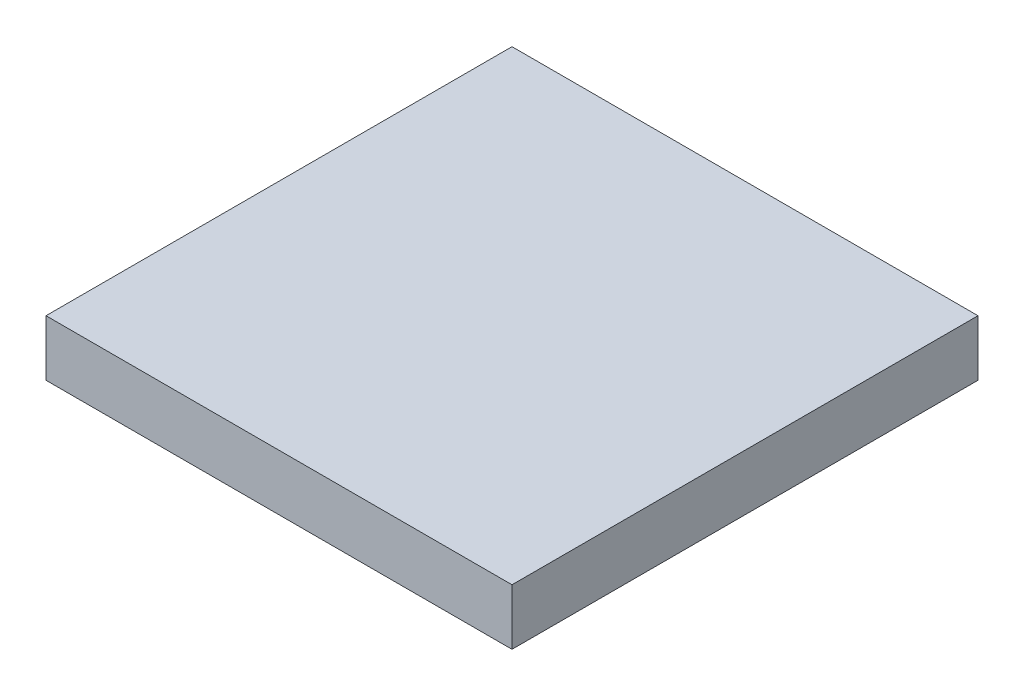
ISO-10303-21;
HEADER;
FILE_DESCRIPTION(('STEP AP214'),'2;1');
FILE_NAME('part.step','',(''),(''),'','','');
FILE_SCHEMA(('AUTOMOTIVE_DESIGN { 1 0 10303 214 1 1 1 1 }'));
ENDSEC;
DATA;
#1=APPLICATION_CONTEXT('core data for automotive mechanical design processes');
#2=APPLICATION_PROTOCOL_DEFINITION('international standard','automotive_design',2000,#1);
#3=PRODUCT_CONTEXT('',#1,'mechanical');
#4=PRODUCT('Part','Part','',(#3));
#5=PRODUCT_RELATED_PRODUCT_CATEGORY('part','',(#4));
#6=PRODUCT_DEFINITION_FORMATION('','',#4);
#7=PRODUCT_DEFINITION_CONTEXT('part definition',#1,'design');
#8=PRODUCT_DEFINITION('design','',#6,#7);
#9=PRODUCT_DEFINITION_SHAPE('','',#8);
#10=(LENGTH_UNIT() NAMED_UNIT(*) SI_UNIT(.MILLI.,.METRE.));
#11=(NAMED_UNIT(*) PLANE_ANGLE_UNIT() SI_UNIT($,.RADIAN.));
#12=(NAMED_UNIT(*) SI_UNIT($,.STERADIAN.) SOLID_ANGLE_UNIT());
#13=UNCERTAINTY_MEASURE_WITH_UNIT(LENGTH_MEASURE(1.E-05),#10,'distance_accuracy_value','');
#14=(GEOMETRIC_REPRESENTATION_CONTEXT(3) GLOBAL_UNCERTAINTY_ASSIGNED_CONTEXT((#13)) GLOBAL_UNIT_ASSIGNED_CONTEXT((#10,
#11,#12)) REPRESENTATION_CONTEXT('',''));
#15=CARTESIAN_POINT('',(0.,0.,0.));
#16=DIRECTION('',(0.,0.,1.));
#17=DIRECTION('',(1.,0.,0.));
#18=AXIS2_PLACEMENT_3D('',#15,#16,#17);
#19=CARTESIAN_POINT('',(12.5,3.,12.5));
#20=DIRECTION('',(-1.,0.,0.));
#21=DIRECTION('',(0.,0.,1.));
#22=AXIS2_PLACEMENT_3D('',#19,#20,#21);
#23=PLANE('',#22);
#24=DIRECTION('',(0.,0.,-1.));
#25=VECTOR('',#24,1.);
#26=CARTESIAN_POINT('',(12.5,0.,12.5));
#27=LINE('',#26,#25);
#28=CARTESIAN_POINT('',(12.5,0.,12.5));
#29=VERTEX_POINT('',#28);
#30=CARTESIAN_POINT('',(12.5,0.,-12.5));
#31=VERTEX_POINT('',#30);
#32=EDGE_CURVE('E145',#29,#31,#27,.T.);
#33=ORIENTED_EDGE('',*,*,#32,.T.);
#34=DIRECTION('',(0.,-1.,0.));
#35=VECTOR('',#34,1.);
#36=CARTESIAN_POINT('',(12.5,3.,-12.5));
#37=LINE('',#36,#35);
#38=CARTESIAN_POINT('',(12.5,3.,-12.5));
#39=VERTEX_POINT('',#38);
#40=EDGE_CURVE('E11',#39,#31,#37,.T.);
#41=ORIENTED_EDGE('',*,*,#40,.F.);
#42=DIRECTION('',(0.,0.,-1.));
#43=VECTOR('',#42,1.);
#44=CARTESIAN_POINT('',(12.5,3.,12.5));
#45=LINE('',#44,#43);
#46=CARTESIAN_POINT('',(12.5,3.,12.5));
#47=VERTEX_POINT('',#46);
#48=EDGE_CURVE('E149',#47,#39,#45,.T.);
#49=ORIENTED_EDGE('',*,*,#48,.F.);
#50=DIRECTION('',(0.,-1.,0.));
#51=VECTOR('',#50,1.);
#52=CARTESIAN_POINT('',(12.5,3.,12.5));
#53=LINE('',#52,#51);
#54=EDGE_CURVE('E155',#47,#29,#53,.T.);
#55=ORIENTED_EDGE('',*,*,#54,.T.);
#56=EDGE_LOOP('',(#33,#41,#49,#55));
#57=FACE_BOUND('',#56,.T.);
#58=ADVANCED_FACE('F33',(#57),#23,.F.);
#59=CARTESIAN_POINT('',(-12.5,3.,-12.5));
#60=DIRECTION('',(0.,0.,1.));
#61=DIRECTION('',(1.,0.,0.));
#62=AXIS2_PLACEMENT_3D('',#59,#60,#61);
#63=PLANE('',#62);
#64=DIRECTION('',(-1.,0.,0.));
#65=VECTOR('',#64,1.);
#66=CARTESIAN_POINT('',(-12.5,0.,-12.5));
#67=LINE('',#66,#65);
#68=CARTESIAN_POINT('',(-12.5,0.,-12.5));
#69=VERTEX_POINT('',#68);
#70=EDGE_CURVE('E158',#31,#69,#67,.T.);
#71=ORIENTED_EDGE('',*,*,#70,.T.);
#72=DIRECTION('',(0.,-1.,0.));
#73=VECTOR('',#72,1.);
#74=CARTESIAN_POINT('',(-12.5,3.,-12.5));
#75=LINE('',#74,#73);
#76=CARTESIAN_POINT('',(-12.5,3.,-12.5));
#77=VERTEX_POINT('',#76);
#78=EDGE_CURVE('E40',#77,#69,#75,.T.);
#79=ORIENTED_EDGE('',*,*,#78,.F.);
#80=DIRECTION('',(-1.,0.,0.));
#81=VECTOR('',#80,1.);
#82=CARTESIAN_POINT('',(-12.5,3.,-12.5));
#83=LINE('',#82,#81);
#84=EDGE_CURVE('E84',#39,#77,#83,.T.);
#85=ORIENTED_EDGE('',*,*,#84,.F.);
#86=ORIENTED_EDGE('',*,*,#40,.T.);
#87=EDGE_LOOP('',(#71,#79,#85,#86));
#88=FACE_BOUND('',#87,.T.);
#89=ADVANCED_FACE('F186',(#88),#63,.F.);
#90=CARTESIAN_POINT('',(-12.5,3.,12.5));
#91=DIRECTION('',(1.,0.,0.));
#92=DIRECTION('',(0.,0.,-1.));
#93=AXIS2_PLACEMENT_3D('',#90,#91,#92);
#94=PLANE('',#93);
#95=DIRECTION('',(0.,0.,1.));
#96=VECTOR('',#95,1.);
#97=CARTESIAN_POINT('',(-12.5,0.,12.5));
#98=LINE('',#97,#96);
#99=CARTESIAN_POINT('',(-12.5,0.,12.5));
#100=VERTEX_POINT('',#99);
#101=EDGE_CURVE('E160',#69,#100,#98,.T.);
#102=ORIENTED_EDGE('',*,*,#101,.T.);
#103=DIRECTION('',(0.,-1.,0.));
#104=VECTOR('',#103,1.);
#105=CARTESIAN_POINT('',(-12.5,3.,12.5));
#106=LINE('',#105,#104);
#107=CARTESIAN_POINT('',(-12.5,3.,12.5));
#108=VERTEX_POINT('',#107);
#109=EDGE_CURVE('E164',#108,#100,#106,.T.);
#110=ORIENTED_EDGE('',*,*,#109,.F.);
#111=DIRECTION('',(0.,0.,1.));
#112=VECTOR('',#111,1.);
#113=CARTESIAN_POINT('',(-12.5,3.,12.5));
#114=LINE('',#113,#112);
#115=EDGE_CURVE('E152',#77,#108,#114,.T.);
#116=ORIENTED_EDGE('',*,*,#115,.F.);
#117=ORIENTED_EDGE('',*,*,#78,.T.);
#118=EDGE_LOOP('',(#102,#110,#116,#117));
#119=FACE_BOUND('',#118,.T.);
#120=ADVANCED_FACE('F169',(#119),#94,.F.);
#121=CARTESIAN_POINT('',(-12.5,3.,12.5));
#122=DIRECTION('',(0.,0.,-1.));
#123=DIRECTION('',(-1.,0.,0.));
#124=AXIS2_PLACEMENT_3D('',#121,#122,#123);
#125=PLANE('',#124);
#126=DIRECTION('',(1.,0.,0.));
#127=VECTOR('',#126,1.);
#128=CARTESIAN_POINT('',(-12.5,0.,12.5));
#129=LINE('',#128,#127);
#130=EDGE_CURVE('E77',#100,#29,#129,.T.);
#131=ORIENTED_EDGE('',*,*,#130,.T.);
#132=ORIENTED_EDGE('',*,*,#54,.F.);
#133=DIRECTION('',(1.,0.,0.));
#134=VECTOR('',#133,1.);
#135=CARTESIAN_POINT('',(-12.5,3.,12.5));
#136=LINE('',#135,#134);
#137=EDGE_CURVE('E56',#108,#47,#136,.T.);
#138=ORIENTED_EDGE('',*,*,#137,.F.);
#139=ORIENTED_EDGE('',*,*,#109,.T.);
#140=EDGE_LOOP('',(#131,#132,#138,#139));
#141=FACE_BOUND('',#140,.T.);
#142=ADVANCED_FACE('F177',(#141),#125,.F.);
#143=CARTESIAN_POINT('',(0.,3.,0.));
#144=DIRECTION('',(0.,-1.,0.));
#145=DIRECTION('',(0.,0.,-1.));
#146=AXIS2_PLACEMENT_3D('',#143,#144,#145);
#147=PLANE('',#146);
#148=ORIENTED_EDGE('',*,*,#48,.T.);
#149=ORIENTED_EDGE('',*,*,#84,.T.);
#150=ORIENTED_EDGE('',*,*,#115,.T.);
#151=ORIENTED_EDGE('',*,*,#137,.T.);
#152=EDGE_LOOP('',(#148,#149,#150,#151));
#153=FACE_BOUND('',#152,.T.);
#154=ADVANCED_FACE('F179',(#153),#147,.F.);
#155=CARTESIAN_POINT('',(0.,0.,0.));
#156=DIRECTION('',(0.,-1.,0.));
#157=DIRECTION('',(0.,0.,-1.));
#158=AXIS2_PLACEMENT_3D('',#155,#156,#157);
#159=PLANE('',#158);
#160=CARTESIAN_POINT('',(-11.,0.,-11.));
#161=DIRECTION('',(0.,-1.,0.));
#162=DIRECTION('',(0.,0.,-1.));
#163=AXIS2_PLACEMENT_3D('',#160,#161,#162);
#164=CIRCLE('',#163,1.25);
#165=CARTESIAN_POINT('',(-11.,0.,-12.25));
#166=VERTEX_POINT('',#165);
#167=EDGE_CURVE('E369',#166,#166,#164,.T.);
#168=ORIENTED_EDGE('',*,*,#167,.F.);
#169=EDGE_LOOP('',(#168));
#170=FACE_BOUND('',#169,.T.);
#171=CARTESIAN_POINT('',(11.,0.,-11.));
#172=DIRECTION('',(0.,-1.,0.));
#173=DIRECTION('',(0.,0.,-1.));
#174=AXIS2_PLACEMENT_3D('',#171,#172,#173);
#175=CIRCLE('',#174,1.25);
#176=CARTESIAN_POINT('',(11.,0.,-12.25));
#177=VERTEX_POINT('',#176);
#178=EDGE_CURVE('E368',#177,#177,#175,.T.);
#179=ORIENTED_EDGE('',*,*,#178,.F.);
#180=EDGE_LOOP('',(#179));
#181=FACE_BOUND('',#180,.T.);
#182=CARTESIAN_POINT('',(11.,0.,11.));
#183=DIRECTION('',(0.,-1.,0.));
#184=DIRECTION('',(0.,0.,-1.));
#185=AXIS2_PLACEMENT_3D('',#182,#183,#184);
#186=CIRCLE('',#185,1.25);
#187=CARTESIAN_POINT('',(11.,0.,9.75));
#188=VERTEX_POINT('',#187);
#189=EDGE_CURVE('E392',#188,#188,#186,.T.);
#190=ORIENTED_EDGE('',*,*,#189,.F.);
#191=EDGE_LOOP('',(#190));
#192=FACE_BOUND('',#191,.T.);
#193=CARTESIAN_POINT('',(-11.,0.,11.));
#194=DIRECTION('',(0.,-1.,0.));
#195=DIRECTION('',(0.,0.,-1.));
#196=AXIS2_PLACEMENT_3D('',#193,#194,#195);
#197=CIRCLE('',#196,1.25);
#198=CARTESIAN_POINT('',(-11.,0.,9.75));
#199=VERTEX_POINT('',#198);
#200=EDGE_CURVE('E381',#199,#199,#197,.T.);
#201=ORIENTED_EDGE('',*,*,#200,.F.);
#202=EDGE_LOOP('',(#201));
#203=FACE_BOUND('',#202,.T.);
#204=DIRECTION('',(0.,0.,1.));
#205=VECTOR('',#204,1.);
#206=CARTESIAN_POINT('',(10.,0.,-10.));
#207=LINE('',#206,#205);
#208=CARTESIAN_POINT('',(10.,0.,-10.));
#209=VERTEX_POINT('',#208);
#210=CARTESIAN_POINT('',(10.,0.,10.));
#211=VERTEX_POINT('',#210);
#212=EDGE_CURVE('E47',#209,#211,#207,.T.);
#213=ORIENTED_EDGE('',*,*,#212,.F.);
#214=DIRECTION('',(1.,0.,0.));
#215=VECTOR('',#214,1.);
#216=CARTESIAN_POINT('',(-10.,0.,-10.));
#217=LINE('',#216,#215);
#218=CARTESIAN_POINT('',(-10.,0.,-10.));
#219=VERTEX_POINT('',#218);
#220=EDGE_CURVE('E126',#219,#209,#217,.T.);
#221=ORIENTED_EDGE('',*,*,#220,.F.);
#222=DIRECTION('',(0.,0.,-1.));
#223=VECTOR('',#222,1.);
#224=CARTESIAN_POINT('',(-10.,0.,-10.));
#225=LINE('',#224,#223);
#226=CARTESIAN_POINT('',(-10.,0.,10.));
#227=VERTEX_POINT('',#226);
#228=EDGE_CURVE('E129',#227,#219,#225,.T.);
#229=ORIENTED_EDGE('',*,*,#228,.F.);
#230=DIRECTION('',(-1.,0.,0.));
#231=VECTOR('',#230,1.);
#232=CARTESIAN_POINT('',(-10.,0.,10.));
#233=LINE('',#232,#231);
#234=EDGE_CURVE('E138',#211,#227,#233,.T.);
#235=ORIENTED_EDGE('',*,*,#234,.F.);
#236=EDGE_LOOP('',(#213,#221,#229,#235));
#237=FACE_BOUND('',#236,.T.);
#238=ORIENTED_EDGE('',*,*,#32,.F.);
#239=ORIENTED_EDGE('',*,*,#130,.F.);
#240=ORIENTED_EDGE('',*,*,#101,.F.);
#241=ORIENTED_EDGE('',*,*,#70,.F.);
#242=EDGE_LOOP('',(#238,#239,#240,#241));
#243=FACE_BOUND('',#242,.T.);
#244=ADVANCED_FACE('F173',(#170,#181,#192,#203,#237,#243),#159,.T.);
#245=CARTESIAN_POINT('',(10.,2.,-10.));
#246=DIRECTION('',(1.,0.,0.));
#247=DIRECTION('',(0.,0.,-1.));
#248=AXIS2_PLACEMENT_3D('',#245,#246,#247);
#249=PLANE('',#248);
#250=ORIENTED_EDGE('',*,*,#212,.T.);
#251=DIRECTION('',(0.,-1.,0.));
#252=VECTOR('',#251,1.);
#253=CARTESIAN_POINT('',(10.,2.,10.));
#254=LINE('',#253,#252);
#255=CARTESIAN_POINT('',(10.,2.,10.));
#256=VERTEX_POINT('',#255);
#257=EDGE_CURVE('E104',#256,#211,#254,.T.);
#258=ORIENTED_EDGE('',*,*,#257,.F.);
#259=DIRECTION('',(0.,0.,1.));
#260=VECTOR('',#259,1.);
#261=CARTESIAN_POINT('',(10.,2.,-10.));
#262=LINE('',#261,#260);
#263=CARTESIAN_POINT('',(10.,2.,-10.));
#264=VERTEX_POINT('',#263);
#265=EDGE_CURVE('E108',#264,#256,#262,.T.);
#266=ORIENTED_EDGE('',*,*,#265,.F.);
#267=DIRECTION('',(0.,-1.,0.));
#268=VECTOR('',#267,1.);
#269=CARTESIAN_POINT('',(10.,2.,-10.));
#270=LINE('',#269,#268);
#271=EDGE_CURVE('E143',#264,#209,#270,.T.);
#272=ORIENTED_EDGE('',*,*,#271,.T.);
#273=EDGE_LOOP('',(#250,#258,#266,#272));
#274=FACE_BOUND('',#273,.T.);
#275=ADVANCED_FACE('F106',(#274),#249,.F.);
#276=CARTESIAN_POINT('',(-10.,2.,-10.));
#277=DIRECTION('',(0.,0.,-1.));
#278=DIRECTION('',(-1.,0.,0.));
#279=AXIS2_PLACEMENT_3D('',#276,#277,#278);
#280=PLANE('',#279);
#281=ORIENTED_EDGE('',*,*,#220,.T.);
#282=ORIENTED_EDGE('',*,*,#271,.F.);
#283=DIRECTION('',(1.,0.,0.));
#284=VECTOR('',#283,1.);
#285=CARTESIAN_POINT('',(-10.,2.,-10.));
#286=LINE('',#285,#284);
#287=CARTESIAN_POINT('',(-10.,2.,-10.));
#288=VERTEX_POINT('',#287);
#289=EDGE_CURVE('E114',#288,#264,#286,.T.);
#290=ORIENTED_EDGE('',*,*,#289,.F.);
#291=DIRECTION('',(0.,-1.,0.));
#292=VECTOR('',#291,1.);
#293=CARTESIAN_POINT('',(-10.,2.,-10.));
#294=LINE('',#293,#292);
#295=EDGE_CURVE('E146',#288,#219,#294,.T.);
#296=ORIENTED_EDGE('',*,*,#295,.T.);
#297=EDGE_LOOP('',(#281,#282,#290,#296));
#298=FACE_BOUND('',#297,.T.);
#299=ADVANCED_FACE('F220',(#298),#280,.F.);
#300=CARTESIAN_POINT('',(-10.,2.,-10.));
#301=DIRECTION('',(-1.,0.,0.));
#302=DIRECTION('',(0.,0.,1.));
#303=AXIS2_PLACEMENT_3D('',#300,#301,#302);
#304=PLANE('',#303);
#305=ORIENTED_EDGE('',*,*,#228,.T.);
#306=ORIENTED_EDGE('',*,*,#295,.F.);
#307=DIRECTION('',(0.,0.,-1.));
#308=VECTOR('',#307,1.);
#309=CARTESIAN_POINT('',(-10.,2.,-10.));
#310=LINE('',#309,#308);
#311=CARTESIAN_POINT('',(-10.,2.,10.));
#312=VERTEX_POINT('',#311);
#313=EDGE_CURVE('E122',#312,#288,#310,.T.);
#314=ORIENTED_EDGE('',*,*,#313,.F.);
#315=DIRECTION('',(0.,-1.,0.));
#316=VECTOR('',#315,1.);
#317=CARTESIAN_POINT('',(-10.,2.,10.));
#318=LINE('',#317,#316);
#319=EDGE_CURVE('E113',#312,#227,#318,.T.);
#320=ORIENTED_EDGE('',*,*,#319,.T.);
#321=EDGE_LOOP('',(#305,#306,#314,#320));
#322=FACE_BOUND('',#321,.T.);
#323=ADVANCED_FACE('F230',(#322),#304,.F.);
#324=CARTESIAN_POINT('',(-10.,2.,10.));
#325=DIRECTION('',(0.,0.,1.));
#326=DIRECTION('',(1.,0.,0.));
#327=AXIS2_PLACEMENT_3D('',#324,#325,#326);
#328=PLANE('',#327);
#329=ORIENTED_EDGE('',*,*,#234,.T.);
#330=ORIENTED_EDGE('',*,*,#319,.F.);
#331=DIRECTION('',(-1.,0.,0.));
#332=VECTOR('',#331,1.);
#333=CARTESIAN_POINT('',(-10.,2.,10.));
#334=LINE('',#333,#332);
#335=EDGE_CURVE('E117',#256,#312,#334,.T.);
#336=ORIENTED_EDGE('',*,*,#335,.F.);
#337=ORIENTED_EDGE('',*,*,#257,.T.);
#338=EDGE_LOOP('',(#329,#330,#336,#337));
#339=FACE_BOUND('',#338,.T.);
#340=ADVANCED_FACE('F118',(#339),#328,.F.);
#341=CARTESIAN_POINT('',(0.,2.,0.));
#342=DIRECTION('',(0.,1.,0.));
#343=DIRECTION('',(0.,0.,1.));
#344=AXIS2_PLACEMENT_3D('',#341,#342,#343);
#345=PLANE('',#344);
#346=CARTESIAN_POINT('',(0.,2.,0.));
#347=DIRECTION('',(0.,-1.,0.));
#348=DIRECTION('',(0.,0.,-1.));
#349=AXIS2_PLACEMENT_3D('',#346,#347,#348);
#350=CIRCLE('',#349,5.);
#351=CARTESIAN_POINT('',(0.,2.,-5.));
#352=VERTEX_POINT('',#351);
#353=EDGE_CURVE('E139',#352,#352,#350,.T.);
#354=ORIENTED_EDGE('',*,*,#353,.F.);
#355=EDGE_LOOP('',(#354));
#356=FACE_BOUND('',#355,.T.);
#357=ORIENTED_EDGE('',*,*,#265,.T.);
#358=ORIENTED_EDGE('',*,*,#335,.T.);
#359=ORIENTED_EDGE('',*,*,#313,.T.);
#360=ORIENTED_EDGE('',*,*,#289,.T.);
#361=EDGE_LOOP('',(#357,#358,#359,#360));
#362=FACE_BOUND('',#361,.T.);
#363=ADVANCED_FACE('F124',(#356,#362),#345,.F.);
#364=CARTESIAN_POINT('',(0.,2.,0.));
#365=DIRECTION('',(0.,-1.,0.));
#366=DIRECTION('',(0.,0.,-1.));
#367=AXIS2_PLACEMENT_3D('',#364,#365,#366);
#368=CYLINDRICAL_SURFACE('',#367,5.);
#369=ORIENTED_EDGE('',*,*,#353,.T.);
#370=EDGE_LOOP('',(#369));
#371=FACE_BOUND('',#370,.T.);
#372=CARTESIAN_POINT('',(0.,0.,0.));
#373=DIRECTION('',(0.,-1.,0.));
#374=DIRECTION('',(0.,0.,-1.));
#375=AXIS2_PLACEMENT_3D('',#372,#373,#374);
#376=CIRCLE('',#375,5.);
#377=CARTESIAN_POINT('',(0.,0.,-5.));
#378=VERTEX_POINT('',#377);
#379=EDGE_CURVE('E132',#378,#378,#376,.T.);
#380=ORIENTED_EDGE('',*,*,#379,.F.);
#381=EDGE_LOOP('',(#380));
#382=FACE_BOUND('',#381,.T.);
#383=ADVANCED_FACE('F257',(#371,#382),#368,.T.);
#384=ORIENTED_EDGE('',*,*,#379,.T.);
#385=EDGE_LOOP('',(#384));
#386=FACE_BOUND('',#385,.T.);
#387=ADVANCED_FACE('F267',(#386),#159,.T.);
#388=CARTESIAN_POINT('',(-11.,2.,11.));
#389=DIRECTION('',(0.,-1.,0.));
#390=DIRECTION('',(0.,0.,-1.));
#391=AXIS2_PLACEMENT_3D('',#388,#389,#390);
#392=CYLINDRICAL_SURFACE('',#391,1.25);
#393=CARTESIAN_POINT('',(-11.,2.,11.));
#394=DIRECTION('',(0.,-1.,0.));
#395=DIRECTION('',(0.,0.,-1.));
#396=AXIS2_PLACEMENT_3D('',#393,#394,#395);
#397=CIRCLE('',#396,1.25);
#398=CARTESIAN_POINT('',(-11.,2.,9.75));
#399=VERTEX_POINT('',#398);
#400=EDGE_CURVE('E378',#399,#399,#397,.T.);
#401=ORIENTED_EDGE('',*,*,#400,.F.);
#402=EDGE_LOOP('',(#401));
#403=FACE_BOUND('',#402,.T.);
#404=ORIENTED_EDGE('',*,*,#200,.T.);
#405=EDGE_LOOP('',(#404));
#406=FACE_BOUND('',#405,.T.);
#407=ADVANCED_FACE('F277',(#403,#406),#392,.F.);
#408=CARTESIAN_POINT('',(-11.,2.,11.));
#409=DIRECTION('',(0.,-1.,0.));
#410=DIRECTION('',(0.,0.,-1.));
#411=AXIS2_PLACEMENT_3D('',#408,#409,#410);
#412=PLANE('',#411);
#413=ORIENTED_EDGE('',*,*,#400,.T.);
#414=EDGE_LOOP('',(#413));
#415=FACE_BOUND('',#414,.T.);
#416=ADVANCED_FACE('F291',(#415),#412,.T.);
#417=CARTESIAN_POINT('',(11.,2.,11.));
#418=DIRECTION('',(0.,-1.,0.));
#419=DIRECTION('',(0.,0.,-1.));
#420=AXIS2_PLACEMENT_3D('',#417,#418,#419);
#421=CYLINDRICAL_SURFACE('',#420,1.25);
#422=CARTESIAN_POINT('',(11.,2.,11.));
#423=DIRECTION('',(0.,-1.,0.));
#424=DIRECTION('',(0.,0.,-1.));
#425=AXIS2_PLACEMENT_3D('',#422,#423,#424);
#426=CIRCLE('',#425,1.25);
#427=CARTESIAN_POINT('',(11.,2.,9.75));
#428=VERTEX_POINT('',#427);
#429=EDGE_CURVE('E383',#428,#428,#426,.T.);
#430=ORIENTED_EDGE('',*,*,#429,.F.);
#431=EDGE_LOOP('',(#430));
#432=FACE_BOUND('',#431,.T.);
#433=ORIENTED_EDGE('',*,*,#189,.T.);
#434=EDGE_LOOP('',(#433));
#435=FACE_BOUND('',#434,.T.);
#436=ADVANCED_FACE('F301',(#432,#435),#421,.F.);
#437=CARTESIAN_POINT('',(11.,2.,11.));
#438=DIRECTION('',(0.,-1.,0.));
#439=DIRECTION('',(0.,0.,-1.));
#440=AXIS2_PLACEMENT_3D('',#437,#438,#439);
#441=PLANE('',#440);
#442=ORIENTED_EDGE('',*,*,#429,.T.);
#443=EDGE_LOOP('',(#442));
#444=FACE_BOUND('',#443,.T.);
#445=ADVANCED_FACE('F311',(#444),#441,.T.);
#446=CARTESIAN_POINT('',(11.,2.,-11.));
#447=DIRECTION('',(0.,-1.,0.));
#448=DIRECTION('',(0.,0.,-1.));
#449=AXIS2_PLACEMENT_3D('',#446,#447,#448);
#450=CYLINDRICAL_SURFACE('',#449,1.25);
#451=CARTESIAN_POINT('',(11.,2.,-11.));
#452=DIRECTION('',(0.,-1.,0.));
#453=DIRECTION('',(0.,0.,-1.));
#454=AXIS2_PLACEMENT_3D('',#451,#452,#453);
#455=CIRCLE('',#454,1.25);
#456=CARTESIAN_POINT('',(11.,2.,-12.25));
#457=VERTEX_POINT('',#456);
#458=EDGE_CURVE('E372',#457,#457,#455,.T.);
#459=ORIENTED_EDGE('',*,*,#458,.F.);
#460=EDGE_LOOP('',(#459));
#461=FACE_BOUND('',#460,.T.);
#462=ORIENTED_EDGE('',*,*,#178,.T.);
#463=EDGE_LOOP('',(#462));
#464=FACE_BOUND('',#463,.T.);
#465=ADVANCED_FACE('F321',(#461,#464),#450,.F.);
#466=CARTESIAN_POINT('',(11.,2.,-11.));
#467=DIRECTION('',(0.,-1.,0.));
#468=DIRECTION('',(0.,0.,-1.));
#469=AXIS2_PLACEMENT_3D('',#466,#467,#468);
#470=PLANE('',#469);
#471=ORIENTED_EDGE('',*,*,#458,.T.);
#472=EDGE_LOOP('',(#471));
#473=FACE_BOUND('',#472,.T.);
#474=ADVANCED_FACE('F331',(#473),#470,.T.);
#475=CARTESIAN_POINT('',(-11.,2.,-11.));
#476=DIRECTION('',(0.,-1.,0.));
#477=DIRECTION('',(0.,0.,-1.));
#478=AXIS2_PLACEMENT_3D('',#475,#476,#477);
#479=CYLINDRICAL_SURFACE('',#478,1.25);
#480=CARTESIAN_POINT('',(-11.,2.,-11.));
#481=DIRECTION('',(0.,-1.,0.));
#482=DIRECTION('',(0.,0.,-1.));
#483=AXIS2_PLACEMENT_3D('',#480,#481,#482);
#484=CIRCLE('',#483,1.25);
#485=CARTESIAN_POINT('',(-11.,2.,-12.25));
#486=VERTEX_POINT('',#485);
#487=EDGE_CURVE('E367',#486,#486,#484,.T.);
#488=ORIENTED_EDGE('',*,*,#487,.F.);
#489=EDGE_LOOP('',(#488));
#490=FACE_BOUND('',#489,.T.);
#491=ORIENTED_EDGE('',*,*,#167,.T.);
#492=EDGE_LOOP('',(#491));
#493=FACE_BOUND('',#492,.T.);
#494=ADVANCED_FACE('F341',(#490,#493),#479,.F.);
#495=CARTESIAN_POINT('',(-11.,2.,-11.));
#496=DIRECTION('',(0.,-1.,0.));
#497=DIRECTION('',(0.,0.,-1.));
#498=AXIS2_PLACEMENT_3D('',#495,#496,#497);
#499=PLANE('',#498);
#500=ORIENTED_EDGE('',*,*,#487,.T.);
#501=EDGE_LOOP('',(#500));
#502=FACE_BOUND('',#501,.T.);
#503=ADVANCED_FACE('F351',(#502),#499,.T.);
#504=CLOSED_SHELL('',(#58,#89,#120,#142,#154,#244,#275,#299,#323,#340,#363,#383,#387,#407,#416,
#436,#445,#465,#474,#494,#503));
#505=MANIFOLD_SOLID_BREP('B2',#504);
#506=ADVANCED_BREP_SHAPE_REPRESENTATION('',(#18,#505),#14);
#507=SHAPE_DEFINITION_REPRESENTATION(#9,#506);
ENDSEC;
END-ISO-10303-21;
